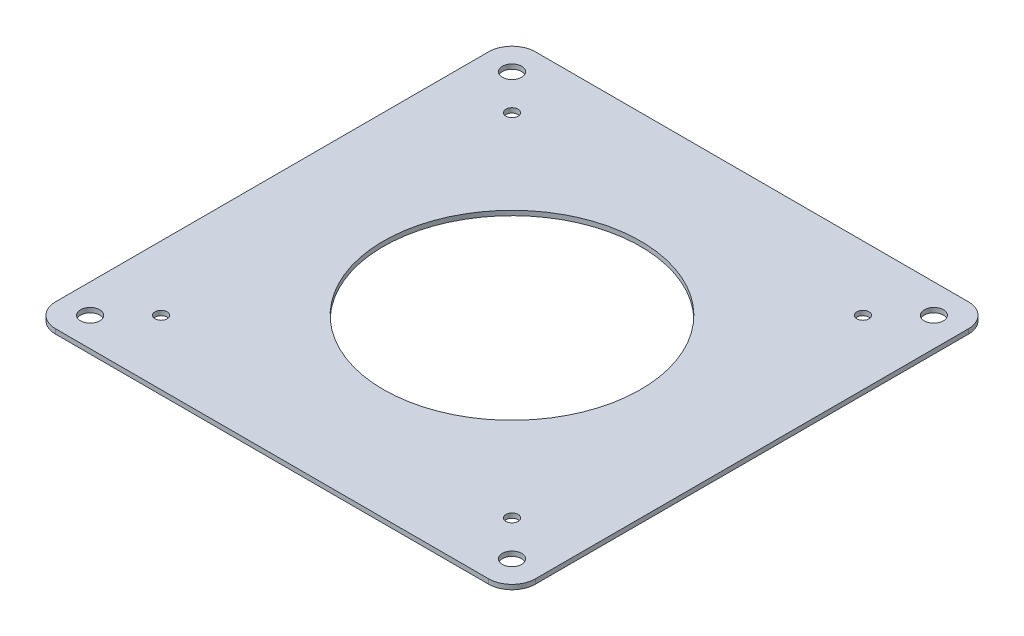
ISO-10303-21;
HEADER;
FILE_DESCRIPTION(('STEP AP214'),'2;1');
FILE_NAME('part.step','',(''),(''),'','','');
FILE_SCHEMA(('AUTOMOTIVE_DESIGN { 1 0 10303 214 1 1 1 1 }'));
ENDSEC;
DATA;
#1=APPLICATION_CONTEXT('core data for automotive mechanical design processes');
#2=APPLICATION_PROTOCOL_DEFINITION('international standard','automotive_design',2000,#1);
#3=PRODUCT_CONTEXT('',#1,'mechanical');
#4=PRODUCT('Part','Part','',(#3));
#5=PRODUCT_RELATED_PRODUCT_CATEGORY('part','',(#4));
#6=PRODUCT_DEFINITION_FORMATION('','',#4);
#7=PRODUCT_DEFINITION_CONTEXT('part definition',#1,'design');
#8=PRODUCT_DEFINITION('design','',#6,#7);
#9=PRODUCT_DEFINITION_SHAPE('','',#8);
#10=(LENGTH_UNIT() NAMED_UNIT(*) SI_UNIT(.MILLI.,.METRE.));
#11=(NAMED_UNIT(*) PLANE_ANGLE_UNIT() SI_UNIT($,.RADIAN.));
#12=(NAMED_UNIT(*) SI_UNIT($,.STERADIAN.) SOLID_ANGLE_UNIT());
#13=UNCERTAINTY_MEASURE_WITH_UNIT(LENGTH_MEASURE(1.E-05),#10,'distance_accuracy_value','');
#14=(GEOMETRIC_REPRESENTATION_CONTEXT(3) GLOBAL_UNCERTAINTY_ASSIGNED_CONTEXT((#13)) GLOBAL_UNIT_ASSIGNED_CONTEXT((#10,
#11,#12)) REPRESENTATION_CONTEXT('',''));
#15=CARTESIAN_POINT('',(0.,0.,0.));
#16=DIRECTION('',(0.,0.,1.));
#17=DIRECTION('',(1.,0.,0.));
#18=AXIS2_PLACEMENT_3D('',#15,#16,#17);
#19=CARTESIAN_POINT('',(46.2,-1.,46.2));
#20=DIRECTION('',(0.,1.,0.));
#21=DIRECTION('',(0.,0.,1.));
#22=AXIS2_PLACEMENT_3D('',#19,#20,#21);
#23=CYLINDRICAL_SURFACE('',#22,5.);
#24=CARTESIAN_POINT('',(46.2,0.,46.2));
#25=DIRECTION('',(0.,1.,0.));
#26=DIRECTION('',(0.,0.,1.));
#27=AXIS2_PLACEMENT_3D('',#24,#25,#26);
#28=CIRCLE('',#27,5.);
#29=CARTESIAN_POINT('',(46.2,0.,51.2));
#30=VERTEX_POINT('',#29);
#31=CARTESIAN_POINT('',(51.2,0.,46.2));
#32=VERTEX_POINT('',#31);
#33=EDGE_CURVE('E136',#30,#32,#28,.T.);
#34=ORIENTED_EDGE('',*,*,#33,.F.);
#35=DIRECTION('',(0.,1.,0.));
#36=VECTOR('',#35,1.);
#37=CARTESIAN_POINT('',(46.2,-1.,51.2));
#38=LINE('',#37,#36);
#39=CARTESIAN_POINT('',(46.2,-1.,51.2));
#40=VERTEX_POINT('',#39);
#41=EDGE_CURVE('E11',#40,#30,#38,.T.);
#42=ORIENTED_EDGE('',*,*,#41,.F.);
#43=CARTESIAN_POINT('',(46.2,-1.,46.2));
#44=DIRECTION('',(0.,1.,0.));
#45=DIRECTION('',(0.,0.,1.));
#46=AXIS2_PLACEMENT_3D('',#43,#44,#45);
#47=CIRCLE('',#46,5.);
#48=CARTESIAN_POINT('',(51.2,-1.,46.2));
#49=VERTEX_POINT('',#48);
#50=EDGE_CURVE('E157',#40,#49,#47,.T.);
#51=ORIENTED_EDGE('',*,*,#50,.T.);
#52=DIRECTION('',(0.,1.,0.));
#53=VECTOR('',#52,1.);
#54=CARTESIAN_POINT('',(51.2,-1.,46.2));
#55=LINE('',#54,#53);
#56=EDGE_CURVE('E42',#49,#32,#55,.T.);
#57=ORIENTED_EDGE('',*,*,#56,.T.);
#58=EDGE_LOOP('',(#34,#42,#51,#57));
#59=FACE_BOUND('',#58,.T.);
#60=ADVANCED_FACE('F39',(#59),#23,.T.);
#61=CARTESIAN_POINT('',(-46.2,-1.,51.2));
#62=DIRECTION('',(0.,0.,1.));
#63=DIRECTION('',(1.,0.,0.));
#64=AXIS2_PLACEMENT_3D('',#61,#62,#63);
#65=PLANE('',#64);
#66=DIRECTION('',(1.,0.,0.));
#67=VECTOR('',#66,1.);
#68=CARTESIAN_POINT('',(-46.2,0.,51.2));
#69=LINE('',#68,#67);
#70=CARTESIAN_POINT('',(-46.2,0.,51.2));
#71=VERTEX_POINT('',#70);
#72=EDGE_CURVE('E155',#71,#30,#69,.T.);
#73=ORIENTED_EDGE('',*,*,#72,.F.);
#74=DIRECTION('',(0.,1.,0.));
#75=VECTOR('',#74,1.);
#76=CARTESIAN_POINT('',(-46.2,-1.,51.2));
#77=LINE('',#76,#75);
#78=CARTESIAN_POINT('',(-46.2,-1.,51.2));
#79=VERTEX_POINT('',#78);
#80=EDGE_CURVE('E48',#79,#71,#77,.T.);
#81=ORIENTED_EDGE('',*,*,#80,.F.);
#82=DIRECTION('',(1.,0.,0.));
#83=VECTOR('',#82,1.);
#84=CARTESIAN_POINT('',(-46.2,-1.,51.2));
#85=LINE('',#84,#83);
#86=EDGE_CURVE('E126',#79,#40,#85,.T.);
#87=ORIENTED_EDGE('',*,*,#86,.T.);
#88=ORIENTED_EDGE('',*,*,#41,.T.);
#89=EDGE_LOOP('',(#73,#81,#87,#88));
#90=FACE_BOUND('',#89,.T.);
#91=ADVANCED_FACE('F169',(#90),#65,.T.);
#92=CARTESIAN_POINT('',(-46.2,-1.,46.2));
#93=DIRECTION('',(0.,1.,0.));
#94=DIRECTION('',(0.,0.,1.));
#95=AXIS2_PLACEMENT_3D('',#92,#93,#94);
#96=CYLINDRICAL_SURFACE('',#95,5.);
#97=CARTESIAN_POINT('',(-46.2,0.,46.2));
#98=DIRECTION('',(0.,1.,0.));
#99=DIRECTION('',(0.,0.,-1.));
#100=AXIS2_PLACEMENT_3D('',#97,#98,#99);
#101=CIRCLE('',#100,5.);
#102=CARTESIAN_POINT('',(-51.2,0.,46.2));
#103=VERTEX_POINT('',#102);
#104=EDGE_CURVE('E113',#103,#71,#101,.T.);
#105=ORIENTED_EDGE('',*,*,#104,.F.);
#106=DIRECTION('',(0.,1.,0.));
#107=VECTOR('',#106,1.);
#108=CARTESIAN_POINT('',(-51.2,-1.,46.2));
#109=LINE('',#108,#107);
#110=CARTESIAN_POINT('',(-51.2,-1.,46.2));
#111=VERTEX_POINT('',#110);
#112=EDGE_CURVE('E108',#111,#103,#109,.T.);
#113=ORIENTED_EDGE('',*,*,#112,.F.);
#114=CARTESIAN_POINT('',(-46.2,-1.,46.2));
#115=DIRECTION('',(0.,1.,0.));
#116=DIRECTION('',(0.,0.,-1.));
#117=AXIS2_PLACEMENT_3D('',#114,#115,#116);
#118=CIRCLE('',#117,5.);
#119=EDGE_CURVE('E111',#111,#79,#118,.T.);
#120=ORIENTED_EDGE('',*,*,#119,.T.);
#121=ORIENTED_EDGE('',*,*,#80,.T.);
#122=EDGE_LOOP('',(#105,#113,#120,#121));
#123=FACE_BOUND('',#122,.T.);
#124=ADVANCED_FACE('F110',(#123),#96,.T.);
#125=CARTESIAN_POINT('',(-51.2,-1.,46.2));
#126=DIRECTION('',(-1.,0.,0.));
#127=DIRECTION('',(0.,0.,1.));
#128=AXIS2_PLACEMENT_3D('',#125,#126,#127);
#129=PLANE('',#128);
#130=DIRECTION('',(0.,0.,1.));
#131=VECTOR('',#130,1.);
#132=CARTESIAN_POINT('',(-51.2,0.,46.2));
#133=LINE('',#132,#131);
#134=CARTESIAN_POINT('',(-51.2,0.,-46.2));
#135=VERTEX_POINT('',#134);
#136=EDGE_CURVE('E152',#135,#103,#133,.T.);
#137=ORIENTED_EDGE('',*,*,#136,.F.);
#138=DIRECTION('',(0.,1.,0.));
#139=VECTOR('',#138,1.);
#140=CARTESIAN_POINT('',(-51.2,-1.,-46.2));
#141=LINE('',#140,#139);
#142=CARTESIAN_POINT('',(-51.2,-1.,-46.2));
#143=VERTEX_POINT('',#142);
#144=EDGE_CURVE('E118',#143,#135,#141,.T.);
#145=ORIENTED_EDGE('',*,*,#144,.F.);
#146=DIRECTION('',(0.,0.,1.));
#147=VECTOR('',#146,1.);
#148=CARTESIAN_POINT('',(-51.2,-1.,46.2));
#149=LINE('',#148,#147);
#150=EDGE_CURVE('E124',#143,#111,#149,.T.);
#151=ORIENTED_EDGE('',*,*,#150,.T.);
#152=ORIENTED_EDGE('',*,*,#112,.T.);
#153=EDGE_LOOP('',(#137,#145,#151,#152));
#154=FACE_BOUND('',#153,.T.);
#155=ADVANCED_FACE('F128',(#154),#129,.T.);
#156=CARTESIAN_POINT('',(-46.2,-1.,-46.2));
#157=DIRECTION('',(0.,1.,0.));
#158=DIRECTION('',(0.,0.,1.));
#159=AXIS2_PLACEMENT_3D('',#156,#157,#158);
#160=CYLINDRICAL_SURFACE('',#159,5.);
#161=CARTESIAN_POINT('',(-46.2,0.,-46.2));
#162=DIRECTION('',(0.,1.,0.));
#163=DIRECTION('',(0.,0.,-1.));
#164=AXIS2_PLACEMENT_3D('',#161,#162,#163);
#165=CIRCLE('',#164,5.);
#166=CARTESIAN_POINT('',(-46.2,0.,-51.2));
#167=VERTEX_POINT('',#166);
#168=EDGE_CURVE('E149',#167,#135,#165,.T.);
#169=ORIENTED_EDGE('',*,*,#168,.F.);
#170=DIRECTION('',(0.,1.,0.));
#171=VECTOR('',#170,1.);
#172=CARTESIAN_POINT('',(-46.2,-1.,-51.2));
#173=LINE('',#172,#171);
#174=CARTESIAN_POINT('',(-46.2,-1.,-51.2));
#175=VERTEX_POINT('',#174);
#176=EDGE_CURVE('E161',#175,#167,#173,.T.);
#177=ORIENTED_EDGE('',*,*,#176,.F.);
#178=CARTESIAN_POINT('',(-46.2,-1.,-46.2));
#179=DIRECTION('',(0.,1.,0.));
#180=DIRECTION('',(0.,0.,-1.));
#181=AXIS2_PLACEMENT_3D('',#178,#179,#180);
#182=CIRCLE('',#181,5.);
#183=EDGE_CURVE('E129',#175,#143,#182,.T.);
#184=ORIENTED_EDGE('',*,*,#183,.T.);
#185=ORIENTED_EDGE('',*,*,#144,.T.);
#186=EDGE_LOOP('',(#169,#177,#184,#185));
#187=FACE_BOUND('',#186,.T.);
#188=ADVANCED_FACE('F182',(#187),#160,.T.);
#189=CARTESIAN_POINT('',(-46.2,-1.,-51.2));
#190=DIRECTION('',(0.,0.,-1.));
#191=DIRECTION('',(-1.,0.,0.));
#192=AXIS2_PLACEMENT_3D('',#189,#190,#191);
#193=PLANE('',#192);
#194=DIRECTION('',(-1.,0.,0.));
#195=VECTOR('',#194,1.);
#196=CARTESIAN_POINT('',(-46.2,0.,-51.2));
#197=LINE('',#196,#195);
#198=CARTESIAN_POINT('',(46.2,0.,-51.2));
#199=VERTEX_POINT('',#198);
#200=EDGE_CURVE('E146',#199,#167,#197,.T.);
#201=ORIENTED_EDGE('',*,*,#200,.F.);
#202=DIRECTION('',(0.,1.,0.));
#203=VECTOR('',#202,1.);
#204=CARTESIAN_POINT('',(46.2,-1.,-51.2));
#205=LINE('',#204,#203);
#206=CARTESIAN_POINT('',(46.2,-1.,-51.2));
#207=VERTEX_POINT('',#206);
#208=EDGE_CURVE('E163',#207,#199,#205,.T.);
#209=ORIENTED_EDGE('',*,*,#208,.F.);
#210=DIRECTION('',(-1.,0.,0.));
#211=VECTOR('',#210,1.);
#212=CARTESIAN_POINT('',(-46.2,-1.,-51.2));
#213=LINE('',#212,#211);
#214=EDGE_CURVE('E131',#207,#175,#213,.T.);
#215=ORIENTED_EDGE('',*,*,#214,.T.);
#216=ORIENTED_EDGE('',*,*,#176,.T.);
#217=EDGE_LOOP('',(#201,#209,#215,#216));
#218=FACE_BOUND('',#217,.T.);
#219=ADVANCED_FACE('F185',(#218),#193,.T.);
#220=CARTESIAN_POINT('',(46.2,-1.,-46.2));
#221=DIRECTION('',(0.,1.,0.));
#222=DIRECTION('',(0.,0.,1.));
#223=AXIS2_PLACEMENT_3D('',#220,#221,#222);
#224=CYLINDRICAL_SURFACE('',#223,5.);
#225=CARTESIAN_POINT('',(46.2,0.,-46.2));
#226=DIRECTION('',(0.,1.,0.));
#227=DIRECTION('',(0.,0.,-1.));
#228=AXIS2_PLACEMENT_3D('',#225,#226,#227);
#229=CIRCLE('',#228,5.);
#230=CARTESIAN_POINT('',(51.2,0.,-46.2));
#231=VERTEX_POINT('',#230);
#232=EDGE_CURVE('E143',#231,#199,#229,.T.);
#233=ORIENTED_EDGE('',*,*,#232,.F.);
#234=DIRECTION('',(0.,1.,0.));
#235=VECTOR('',#234,1.);
#236=CARTESIAN_POINT('',(51.2,-1.,-46.2));
#237=LINE('',#236,#235);
#238=CARTESIAN_POINT('',(51.2,-1.,-46.2));
#239=VERTEX_POINT('',#238);
#240=EDGE_CURVE('E164',#239,#231,#237,.T.);
#241=ORIENTED_EDGE('',*,*,#240,.F.);
#242=CARTESIAN_POINT('',(46.2,-1.,-46.2));
#243=DIRECTION('',(0.,1.,0.));
#244=DIRECTION('',(0.,0.,-1.));
#245=AXIS2_PLACEMENT_3D('',#242,#243,#244);
#246=CIRCLE('',#245,5.);
#247=EDGE_CURVE('E301',#239,#207,#246,.T.);
#248=ORIENTED_EDGE('',*,*,#247,.T.);
#249=ORIENTED_EDGE('',*,*,#208,.T.);
#250=EDGE_LOOP('',(#233,#241,#248,#249));
#251=FACE_BOUND('',#250,.T.);
#252=ADVANCED_FACE('F189',(#251),#224,.T.);
#253=CARTESIAN_POINT('',(51.2,-1.,46.2));
#254=DIRECTION('',(1.,0.,0.));
#255=DIRECTION('',(0.,0.,-1.));
#256=AXIS2_PLACEMENT_3D('',#253,#254,#255);
#257=PLANE('',#256);
#258=DIRECTION('',(0.,0.,-1.));
#259=VECTOR('',#258,1.);
#260=CARTESIAN_POINT('',(51.2,0.,46.2));
#261=LINE('',#260,#259);
#262=EDGE_CURVE('E139',#32,#231,#261,.T.);
#263=ORIENTED_EDGE('',*,*,#262,.F.);
#264=ORIENTED_EDGE('',*,*,#56,.F.);
#265=DIRECTION('',(0.,0.,-1.));
#266=VECTOR('',#265,1.);
#267=CARTESIAN_POINT('',(51.2,-1.,46.2));
#268=LINE('',#267,#266);
#269=EDGE_CURVE('E299',#49,#239,#268,.T.);
#270=ORIENTED_EDGE('',*,*,#269,.T.);
#271=ORIENTED_EDGE('',*,*,#240,.T.);
#272=EDGE_LOOP('',(#263,#264,#270,#271));
#273=FACE_BOUND('',#272,.T.);
#274=ADVANCED_FACE('F166',(#273),#257,.T.);
#275=CARTESIAN_POINT('',(46.2,-1.,46.2));
#276=DIRECTION('',(0.,1.,0.));
#277=DIRECTION('',(0.,0.,1.));
#278=AXIS2_PLACEMENT_3D('',#275,#276,#277);
#279=PLANE('',#278);
#280=CARTESIAN_POINT('',(37.4500000000004,-0.999999999999999,37.4499999999996));
#281=DIRECTION('',(0.,1.,0.));
#282=DIRECTION('',(0.,0.,1.));
#283=AXIS2_PLACEMENT_3D('',#280,#281,#282);
#284=CIRCLE('',#283,1.3);
#285=CARTESIAN_POINT('',(37.4500000000004,-0.999999999999999,38.7499999999996));
#286=VERTEX_POINT('',#285);
#287=EDGE_CURVE('E247',#286,#286,#284,.T.);
#288=ORIENTED_EDGE('',*,*,#287,.T.);
#289=EDGE_LOOP('',(#288));
#290=FACE_BOUND('',#289,.T.);
#291=CARTESIAN_POINT('',(45.0200000000005,-0.999999999999999,45.0199999999995));
#292=DIRECTION('',(0.,1.,0.));
#293=DIRECTION('',(0.,0.,1.));
#294=AXIS2_PLACEMENT_3D('',#291,#292,#293);
#295=CIRCLE('',#294,2.04999999999999);
#296=CARTESIAN_POINT('',(45.0200000000005,-0.999999999999999,47.0699999999995));
#297=VERTEX_POINT('',#296);
#298=EDGE_CURVE('E251',#297,#297,#295,.T.);
#299=ORIENTED_EDGE('',*,*,#298,.T.);
#300=EDGE_LOOP('',(#299));
#301=FACE_BOUND('',#300,.T.);
#302=CARTESIAN_POINT('',(-37.45,-0.999999999999999,37.45));
#303=DIRECTION('',(0.,1.,0.));
#304=DIRECTION('',(0.,0.,1.));
#305=AXIS2_PLACEMENT_3D('',#302,#303,#304);
#306=CIRCLE('',#305,1.3);
#307=CARTESIAN_POINT('',(-37.45,-0.999999999999999,38.75));
#308=VERTEX_POINT('',#307);
#309=EDGE_CURVE('E260',#308,#308,#306,.T.);
#310=ORIENTED_EDGE('',*,*,#309,.T.);
#311=EDGE_LOOP('',(#310));
#312=FACE_BOUND('',#311,.T.);
#313=CARTESIAN_POINT('',(-45.02,-0.999999999999999,45.02));
#314=DIRECTION('',(0.,1.,0.));
#315=DIRECTION('',(0.,0.,1.));
#316=AXIS2_PLACEMENT_3D('',#313,#314,#315);
#317=CIRCLE('',#316,2.04999999999999);
#318=CARTESIAN_POINT('',(-45.02,-0.999999999999999,47.07));
#319=VERTEX_POINT('',#318);
#320=EDGE_CURVE('E266',#319,#319,#317,.T.);
#321=ORIENTED_EDGE('',*,*,#320,.T.);
#322=EDGE_LOOP('',(#321));
#323=FACE_BOUND('',#322,.T.);
#324=CARTESIAN_POINT('',(-37.4500000000001,-0.999999999999999,-37.4499999999999));
#325=DIRECTION('',(0.,1.,0.));
#326=DIRECTION('',(0.,0.,1.));
#327=AXIS2_PLACEMENT_3D('',#324,#325,#326);
#328=CIRCLE('',#327,1.3);
#329=CARTESIAN_POINT('',(-37.4500000000001,-0.999999999999999,-36.1499999999999));
#330=VERTEX_POINT('',#329);
#331=EDGE_CURVE('E272',#330,#330,#328,.T.);
#332=ORIENTED_EDGE('',*,*,#331,.T.);
#333=EDGE_LOOP('',(#332));
#334=FACE_BOUND('',#333,.T.);
#335=CARTESIAN_POINT('',(-45.0200000000002,-0.999999999999999,-45.0199999999999));
#336=DIRECTION('',(0.,1.,0.));
#337=DIRECTION('',(0.,0.,1.));
#338=AXIS2_PLACEMENT_3D('',#335,#336,#337);
#339=CIRCLE('',#338,2.04999999999999);
#340=CARTESIAN_POINT('',(-45.0200000000002,-0.999999999999999,-42.9699999999999));
#341=VERTEX_POINT('',#340);
#342=EDGE_CURVE('E278',#341,#341,#339,.T.);
#343=ORIENTED_EDGE('',*,*,#342,.T.);
#344=EDGE_LOOP('',(#343));
#345=FACE_BOUND('',#344,.T.);
#346=CARTESIAN_POINT('',(37.45,-0.999999999999999,-37.45));
#347=DIRECTION('',(0.,1.,0.));
#348=DIRECTION('',(0.,0.,1.));
#349=AXIS2_PLACEMENT_3D('',#346,#347,#348);
#350=CIRCLE('',#349,1.3);
#351=CARTESIAN_POINT('',(37.45,-0.999999999999999,-36.15));
#352=VERTEX_POINT('',#351);
#353=EDGE_CURVE('E284',#352,#352,#350,.T.);
#354=ORIENTED_EDGE('',*,*,#353,.T.);
#355=EDGE_LOOP('',(#354));
#356=FACE_BOUND('',#355,.T.);
#357=CARTESIAN_POINT('',(45.02,-0.999999999999999,-45.02));
#358=DIRECTION('',(0.,1.,0.));
#359=DIRECTION('',(0.,0.,1.));
#360=AXIS2_PLACEMENT_3D('',#357,#358,#359);
#361=CIRCLE('',#360,2.04999999999999);
#362=CARTESIAN_POINT('',(45.02,-0.999999999999999,-42.97));
#363=VERTEX_POINT('',#362);
#364=EDGE_CURVE('E290',#363,#363,#361,.T.);
#365=ORIENTED_EDGE('',*,*,#364,.T.);
#366=EDGE_LOOP('',(#365));
#367=FACE_BOUND('',#366,.T.);
#368=CARTESIAN_POINT('',(0.,-0.999999999999999,0.));
#369=DIRECTION('',(0.,1.,0.));
#370=DIRECTION('',(0.,0.,1.));
#371=AXIS2_PLACEMENT_3D('',#368,#369,#370);
#372=CIRCLE('',#371,27.45);
#373=CARTESIAN_POINT('',(0.,-0.999999999999999,27.45));
#374=VERTEX_POINT('',#373);
#375=EDGE_CURVE('E140',#374,#374,#372,.T.);
#376=ORIENTED_EDGE('',*,*,#375,.T.);
#377=EDGE_LOOP('',(#376));
#378=FACE_BOUND('',#377,.T.);
#379=ORIENTED_EDGE('',*,*,#50,.F.);
#380=ORIENTED_EDGE('',*,*,#86,.F.);
#381=ORIENTED_EDGE('',*,*,#119,.F.);
#382=ORIENTED_EDGE('',*,*,#150,.F.);
#383=ORIENTED_EDGE('',*,*,#183,.F.);
#384=ORIENTED_EDGE('',*,*,#214,.F.);
#385=ORIENTED_EDGE('',*,*,#247,.F.);
#386=ORIENTED_EDGE('',*,*,#269,.F.);
#387=EDGE_LOOP('',(#379,#380,#381,#382,#383,#384,#385,#386));
#388=FACE_BOUND('',#387,.T.);
#389=ADVANCED_FACE('F122',(#290,#301,#312,#323,#334,#345,#356,#367,#378,#388),#279,.F.);
#390=CARTESIAN_POINT('',(46.2,0.,46.2));
#391=DIRECTION('',(0.,1.,0.));
#392=DIRECTION('',(0.,0.,1.));
#393=AXIS2_PLACEMENT_3D('',#390,#391,#392);
#394=PLANE('',#393);
#395=CARTESIAN_POINT('',(37.4500000000004,0.,37.4499999999996));
#396=DIRECTION('',(0.,1.,0.));
#397=DIRECTION('',(-1.,0.,0.));
#398=AXIS2_PLACEMENT_3D('',#395,#396,#397);
#399=CIRCLE('',#398,1.3);
#400=CARTESIAN_POINT('',(36.1500000000004,0.,37.4499999999996));
#401=VERTEX_POINT('',#400);
#402=EDGE_CURVE('E245',#401,#401,#399,.T.);
#403=ORIENTED_EDGE('',*,*,#402,.F.);
#404=EDGE_LOOP('',(#403));
#405=FACE_BOUND('',#404,.T.);
#406=CARTESIAN_POINT('',(45.0200000000005,0.,45.0199999999995));
#407=DIRECTION('',(0.,1.,0.));
#408=DIRECTION('',(-1.,0.,0.));
#409=AXIS2_PLACEMENT_3D('',#406,#407,#408);
#410=CIRCLE('',#409,2.04999999999999);
#411=CARTESIAN_POINT('',(42.9700000000005,0.,45.0199999999996));
#412=VERTEX_POINT('',#411);
#413=EDGE_CURVE('E248',#412,#412,#410,.T.);
#414=ORIENTED_EDGE('',*,*,#413,.F.);
#415=EDGE_LOOP('',(#414));
#416=FACE_BOUND('',#415,.T.);
#417=CARTESIAN_POINT('',(-37.45,0.,37.45));
#418=DIRECTION('',(0.,1.,0.));
#419=DIRECTION('',(0.,0.,-1.));
#420=AXIS2_PLACEMENT_3D('',#417,#418,#419);
#421=CIRCLE('',#420,1.3);
#422=CARTESIAN_POINT('',(-37.45,0.,36.15));
#423=VERTEX_POINT('',#422);
#424=EDGE_CURVE('E257',#423,#423,#421,.T.);
#425=ORIENTED_EDGE('',*,*,#424,.F.);
#426=EDGE_LOOP('',(#425));
#427=FACE_BOUND('',#426,.T.);
#428=CARTESIAN_POINT('',(-45.02,0.,45.02));
#429=DIRECTION('',(0.,1.,0.));
#430=DIRECTION('',(0.,0.,-1.));
#431=AXIS2_PLACEMENT_3D('',#428,#429,#430);
#432=CIRCLE('',#431,2.04999999999999);
#433=CARTESIAN_POINT('',(-45.02,0.,42.97));
#434=VERTEX_POINT('',#433);
#435=EDGE_CURVE('E263',#434,#434,#432,.T.);
#436=ORIENTED_EDGE('',*,*,#435,.F.);
#437=EDGE_LOOP('',(#436));
#438=FACE_BOUND('',#437,.T.);
#439=CARTESIAN_POINT('',(-37.4500000000001,0.,-37.4499999999999));
#440=DIRECTION('',(0.,1.,0.));
#441=DIRECTION('',(1.,0.,0.));
#442=AXIS2_PLACEMENT_3D('',#439,#440,#441);
#443=CIRCLE('',#442,1.3);
#444=CARTESIAN_POINT('',(-36.1500000000001,0.,-37.4499999999999));
#445=VERTEX_POINT('',#444);
#446=EDGE_CURVE('E269',#445,#445,#443,.T.);
#447=ORIENTED_EDGE('',*,*,#446,.F.);
#448=EDGE_LOOP('',(#447));
#449=FACE_BOUND('',#448,.T.);
#450=CARTESIAN_POINT('',(-45.0200000000002,0.,-45.0199999999999));
#451=DIRECTION('',(0.,1.,0.));
#452=DIRECTION('',(1.,0.,0.));
#453=AXIS2_PLACEMENT_3D('',#450,#451,#452);
#454=CIRCLE('',#453,2.04999999999999);
#455=CARTESIAN_POINT('',(-42.9700000000002,0.,-45.0199999999999));
#456=VERTEX_POINT('',#455);
#457=EDGE_CURVE('E275',#456,#456,#454,.T.);
#458=ORIENTED_EDGE('',*,*,#457,.F.);
#459=EDGE_LOOP('',(#458));
#460=FACE_BOUND('',#459,.T.);
#461=CARTESIAN_POINT('',(37.45,0.,-37.45));
#462=DIRECTION('',(0.,1.,0.));
#463=DIRECTION('',(0.,0.,1.));
#464=AXIS2_PLACEMENT_3D('',#461,#462,#463);
#465=CIRCLE('',#464,1.3);
#466=CARTESIAN_POINT('',(37.45,0.,-36.15));
#467=VERTEX_POINT('',#466);
#468=EDGE_CURVE('E281',#467,#467,#465,.T.);
#469=ORIENTED_EDGE('',*,*,#468,.F.);
#470=EDGE_LOOP('',(#469));
#471=FACE_BOUND('',#470,.T.);
#472=CARTESIAN_POINT('',(45.02,0.,-45.02));
#473=DIRECTION('',(0.,1.,0.));
#474=DIRECTION('',(0.,0.,1.));
#475=AXIS2_PLACEMENT_3D('',#472,#473,#474);
#476=CIRCLE('',#475,2.04999999999999);
#477=CARTESIAN_POINT('',(45.02,0.,-42.97));
#478=VERTEX_POINT('',#477);
#479=EDGE_CURVE('E287',#478,#478,#476,.T.);
#480=ORIENTED_EDGE('',*,*,#479,.F.);
#481=EDGE_LOOP('',(#480));
#482=FACE_BOUND('',#481,.T.);
#483=CARTESIAN_POINT('',(0.,0.,0.));
#484=DIRECTION('',(0.,1.,0.));
#485=DIRECTION('',(0.,0.,1.));
#486=AXIS2_PLACEMENT_3D('',#483,#484,#485);
#487=CIRCLE('',#486,27.45);
#488=CARTESIAN_POINT('',(0.,0.,27.45));
#489=VERTEX_POINT('',#488);
#490=EDGE_CURVE('E293',#489,#489,#487,.T.);
#491=ORIENTED_EDGE('',*,*,#490,.F.);
#492=EDGE_LOOP('',(#491));
#493=FACE_BOUND('',#492,.T.);
#494=ORIENTED_EDGE('',*,*,#33,.T.);
#495=ORIENTED_EDGE('',*,*,#262,.T.);
#496=ORIENTED_EDGE('',*,*,#232,.T.);
#497=ORIENTED_EDGE('',*,*,#200,.T.);
#498=ORIENTED_EDGE('',*,*,#168,.T.);
#499=ORIENTED_EDGE('',*,*,#136,.T.);
#500=ORIENTED_EDGE('',*,*,#104,.T.);
#501=ORIENTED_EDGE('',*,*,#72,.T.);
#502=EDGE_LOOP('',(#494,#495,#496,#497,#498,#499,#500,#501));
#503=FACE_BOUND('',#502,.T.);
#504=ADVANCED_FACE('F168',(#405,#416,#427,#438,#449,#460,#471,#482,#493,#503),#394,.T.);
#505=CARTESIAN_POINT('',(0.,-10.,0.));
#506=DIRECTION('',(0.,1.,0.));
#507=DIRECTION('',(0.,0.,1.));
#508=AXIS2_PLACEMENT_3D('',#505,#506,#507);
#509=CYLINDRICAL_SURFACE('',#508,27.45);
#510=ORIENTED_EDGE('',*,*,#490,.T.);
#511=EDGE_LOOP('',(#510));
#512=FACE_BOUND('',#511,.T.);
#513=ORIENTED_EDGE('',*,*,#375,.F.);
#514=EDGE_LOOP('',(#513));
#515=FACE_BOUND('',#514,.T.);
#516=ADVANCED_FACE('F201',(#512,#515),#509,.F.);
#517=CARTESIAN_POINT('',(45.02,-10.,-45.02));
#518=DIRECTION('',(0.,1.,0.));
#519=DIRECTION('',(0.,0.,1.));
#520=AXIS2_PLACEMENT_3D('',#517,#518,#519);
#521=CYLINDRICAL_SURFACE('',#520,2.04999999999999);
#522=ORIENTED_EDGE('',*,*,#479,.T.);
#523=EDGE_LOOP('',(#522));
#524=FACE_BOUND('',#523,.T.);
#525=ORIENTED_EDGE('',*,*,#364,.F.);
#526=EDGE_LOOP('',(#525));
#527=FACE_BOUND('',#526,.T.);
#528=ADVANCED_FACE('F208',(#524,#527),#521,.F.);
#529=CARTESIAN_POINT('',(37.45,-10.,-37.45));
#530=DIRECTION('',(0.,1.,0.));
#531=DIRECTION('',(0.,0.,1.));
#532=AXIS2_PLACEMENT_3D('',#529,#530,#531);
#533=CYLINDRICAL_SURFACE('',#532,1.3);
#534=ORIENTED_EDGE('',*,*,#468,.T.);
#535=EDGE_LOOP('',(#534));
#536=FACE_BOUND('',#535,.T.);
#537=ORIENTED_EDGE('',*,*,#353,.F.);
#538=EDGE_LOOP('',(#537));
#539=FACE_BOUND('',#538,.T.);
#540=ADVANCED_FACE('F212',(#536,#539),#533,.F.);
#541=CARTESIAN_POINT('',(-45.0200000000002,-10.,-45.0199999999999));
#542=DIRECTION('',(0.,1.,0.));
#543=DIRECTION('',(0.,0.,1.));
#544=AXIS2_PLACEMENT_3D('',#541,#542,#543);
#545=CYLINDRICAL_SURFACE('',#544,2.04999999999999);
#546=ORIENTED_EDGE('',*,*,#457,.T.);
#547=EDGE_LOOP('',(#546));
#548=FACE_BOUND('',#547,.T.);
#549=ORIENTED_EDGE('',*,*,#342,.F.);
#550=EDGE_LOOP('',(#549));
#551=FACE_BOUND('',#550,.T.);
#552=ADVANCED_FACE('F216',(#548,#551),#545,.F.);
#553=CARTESIAN_POINT('',(-37.4500000000001,-10.,-37.4499999999999));
#554=DIRECTION('',(0.,1.,0.));
#555=DIRECTION('',(0.,0.,1.));
#556=AXIS2_PLACEMENT_3D('',#553,#554,#555);
#557=CYLINDRICAL_SURFACE('',#556,1.3);
#558=ORIENTED_EDGE('',*,*,#446,.T.);
#559=EDGE_LOOP('',(#558));
#560=FACE_BOUND('',#559,.T.);
#561=ORIENTED_EDGE('',*,*,#331,.F.);
#562=EDGE_LOOP('',(#561));
#563=FACE_BOUND('',#562,.T.);
#564=ADVANCED_FACE('F220',(#560,#563),#557,.F.);
#565=CARTESIAN_POINT('',(-45.02,-10.,45.02));
#566=DIRECTION('',(0.,1.,0.));
#567=DIRECTION('',(0.,0.,1.));
#568=AXIS2_PLACEMENT_3D('',#565,#566,#567);
#569=CYLINDRICAL_SURFACE('',#568,2.04999999999999);
#570=ORIENTED_EDGE('',*,*,#435,.T.);
#571=EDGE_LOOP('',(#570));
#572=FACE_BOUND('',#571,.T.);
#573=ORIENTED_EDGE('',*,*,#320,.F.);
#574=EDGE_LOOP('',(#573));
#575=FACE_BOUND('',#574,.T.);
#576=ADVANCED_FACE('F224',(#572,#575),#569,.F.);
#577=CARTESIAN_POINT('',(-37.45,-10.,37.45));
#578=DIRECTION('',(0.,1.,0.));
#579=DIRECTION('',(0.,0.,1.));
#580=AXIS2_PLACEMENT_3D('',#577,#578,#579);
#581=CYLINDRICAL_SURFACE('',#580,1.3);
#582=ORIENTED_EDGE('',*,*,#424,.T.);
#583=EDGE_LOOP('',(#582));
#584=FACE_BOUND('',#583,.T.);
#585=ORIENTED_EDGE('',*,*,#309,.F.);
#586=EDGE_LOOP('',(#585));
#587=FACE_BOUND('',#586,.T.);
#588=ADVANCED_FACE('F228',(#584,#587),#581,.F.);
#589=CARTESIAN_POINT('',(45.0200000000005,-10.,45.0199999999995));
#590=DIRECTION('',(0.,1.,0.));
#591=DIRECTION('',(0.,0.,1.));
#592=AXIS2_PLACEMENT_3D('',#589,#590,#591);
#593=CYLINDRICAL_SURFACE('',#592,2.04999999999999);
#594=ORIENTED_EDGE('',*,*,#413,.T.);
#595=EDGE_LOOP('',(#594));
#596=FACE_BOUND('',#595,.T.);
#597=ORIENTED_EDGE('',*,*,#298,.F.);
#598=EDGE_LOOP('',(#597));
#599=FACE_BOUND('',#598,.T.);
#600=ADVANCED_FACE('F232',(#596,#599),#593,.F.);
#601=CARTESIAN_POINT('',(37.4500000000004,-10.,37.4499999999996));
#602=DIRECTION('',(0.,1.,0.));
#603=DIRECTION('',(0.,0.,1.));
#604=AXIS2_PLACEMENT_3D('',#601,#602,#603);
#605=CYLINDRICAL_SURFACE('',#604,1.3);
#606=ORIENTED_EDGE('',*,*,#402,.T.);
#607=EDGE_LOOP('',(#606));
#608=FACE_BOUND('',#607,.T.);
#609=ORIENTED_EDGE('',*,*,#287,.F.);
#610=EDGE_LOOP('',(#609));
#611=FACE_BOUND('',#610,.T.);
#612=ADVANCED_FACE('F236',(#608,#611),#605,.F.);
#613=CLOSED_SHELL('',(#60,#91,#124,#155,#188,#219,#252,#274,#389,#504,#516,#528,#540,#552,#564,
#576,#588,#600,#612));
#614=MANIFOLD_SOLID_BREP('B2',#613);
#615=ADVANCED_BREP_SHAPE_REPRESENTATION('',(#18,#614),#14);
#616=SHAPE_DEFINITION_REPRESENTATION(#9,#615);
ENDSEC;
END-ISO-10303-21;
